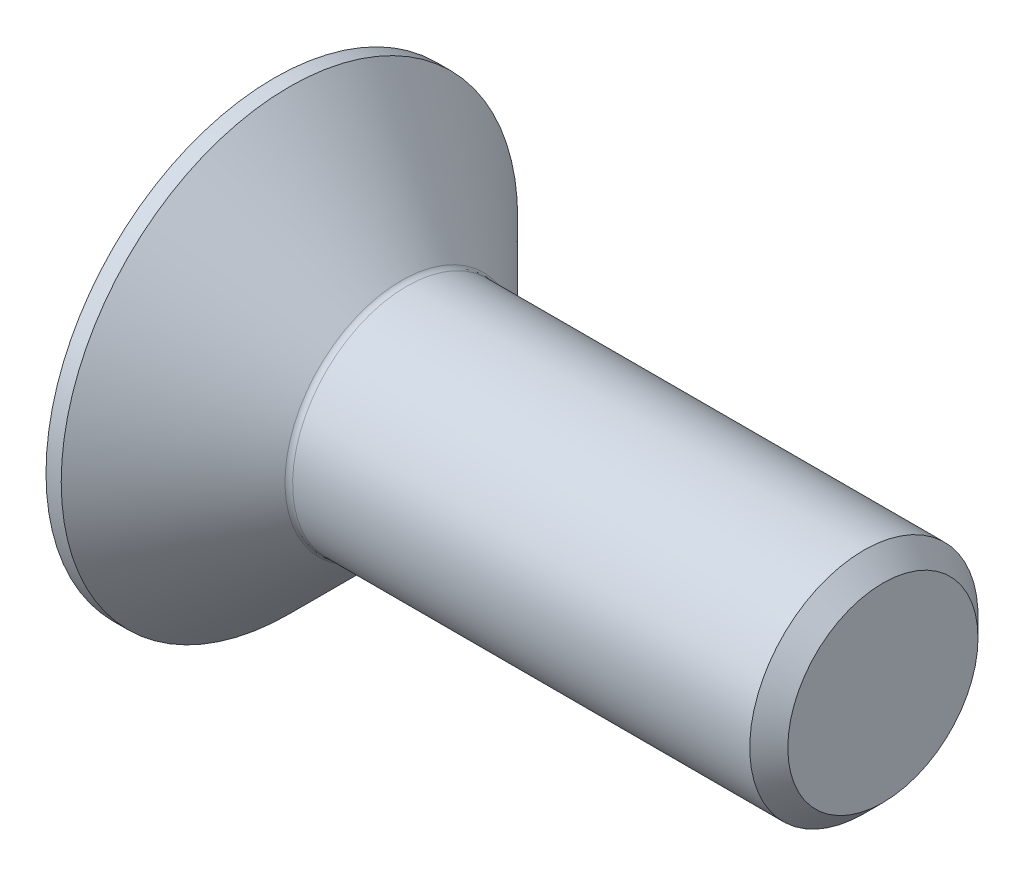
ISO-10303-21;
HEADER;
FILE_DESCRIPTION(('STEP AP214'),'2;1');
FILE_NAME('part.step','',(''),(''),'','','');
FILE_SCHEMA(('AUTOMOTIVE_DESIGN { 1 0 10303 214 1 1 1 1 }'));
ENDSEC;
DATA;
#1=APPLICATION_CONTEXT('core data for automotive mechanical design processes');
#2=APPLICATION_PROTOCOL_DEFINITION('international standard','automotive_design',2000,#1);
#3=PRODUCT_CONTEXT('',#1,'mechanical');
#4=PRODUCT('Part','Part','',(#3));
#5=PRODUCT_RELATED_PRODUCT_CATEGORY('part','',(#4));
#6=PRODUCT_DEFINITION_FORMATION('','',#4);
#7=PRODUCT_DEFINITION_CONTEXT('part definition',#1,'design');
#8=PRODUCT_DEFINITION('design','',#6,#7);
#9=PRODUCT_DEFINITION_SHAPE('','',#8);
#10=(LENGTH_UNIT() NAMED_UNIT(*) SI_UNIT(.MILLI.,.METRE.));
#11=(NAMED_UNIT(*) PLANE_ANGLE_UNIT() SI_UNIT($,.RADIAN.));
#12=(NAMED_UNIT(*) SI_UNIT($,.STERADIAN.) SOLID_ANGLE_UNIT());
#13=UNCERTAINTY_MEASURE_WITH_UNIT(LENGTH_MEASURE(1.E-05),#10,'distance_accuracy_value','');
#14=(GEOMETRIC_REPRESENTATION_CONTEXT(3) GLOBAL_UNCERTAINTY_ASSIGNED_CONTEXT((#13)) GLOBAL_UNIT_ASSIGNED_CONTEXT((#10,
#11,#12)) REPRESENTATION_CONTEXT('',''));
#15=CARTESIAN_POINT('',(0.,0.,0.));
#16=DIRECTION('',(0.,0.,1.));
#17=DIRECTION('',(1.,0.,0.));
#18=AXIS2_PLACEMENT_3D('',#15,#16,#17);
#19=CARTESIAN_POINT('',(1.2,0.,0.));
#20=DIRECTION('',(1.,0.,0.));
#21=DIRECTION('',(0.,1.,0.));
#22=AXIS2_PLACEMENT_3D('',#19,#20,#21);
#23=PLANE('',#22);
#24=DIRECTION('',(0.,-0.5,-0.866025403784439));
#25=VECTOR('',#24,1.);
#26=CARTESIAN_POINT('',(1.2,-1.15470053837925,0.));
#27=LINE('',#26,#25);
#28=CARTESIAN_POINT('',(1.2,-1.15470053837925,0.));
#29=VERTEX_POINT('',#28);
#30=CARTESIAN_POINT('',(1.2,-0.577350269189626,1.));
#31=VERTEX_POINT('',#30);
#32=EDGE_CURVE('E126',#29,#31,#27,.F.);
#33=ORIENTED_EDGE('',*,*,#32,.T.);
#34=DIRECTION('',(0.,-1.,0.));
#35=VECTOR('',#34,1.);
#36=CARTESIAN_POINT('',(1.2,-0.577350269189626,1.));
#37=LINE('',#36,#35);
#38=CARTESIAN_POINT('',(1.2,0.577350269189626,1.));
#39=VERTEX_POINT('',#38);
#40=EDGE_CURVE('E130',#31,#39,#37,.F.);
#41=ORIENTED_EDGE('',*,*,#40,.T.);
#42=DIRECTION('',(0.,-0.499999999999999,0.866025403784439));
#43=VECTOR('',#42,1.);
#44=CARTESIAN_POINT('',(1.2,0.577350269189626,1.));
#45=LINE('',#44,#43);
#46=CARTESIAN_POINT('',(1.2,1.15470053837925,0.));
#47=VERTEX_POINT('',#46);
#48=EDGE_CURVE('E135',#39,#47,#45,.F.);
#49=ORIENTED_EDGE('',*,*,#48,.T.);
#50=DIRECTION('',(0.,0.5,0.866025403784439));
#51=VECTOR('',#50,1.);
#52=CARTESIAN_POINT('',(1.2,1.15470053837925,0.));
#53=LINE('',#52,#51);
#54=CARTESIAN_POINT('',(1.2,0.577350269189626,-1.));
#55=VERTEX_POINT('',#54);
#56=EDGE_CURVE('E85',#47,#55,#53,.F.);
#57=ORIENTED_EDGE('',*,*,#56,.T.);
#58=DIRECTION('',(0.,1.,0.));
#59=VECTOR('',#58,1.);
#60=CARTESIAN_POINT('',(1.2,0.577350269189626,-1.));
#61=LINE('',#60,#59);
#62=CARTESIAN_POINT('',(1.2,-0.577350269189627,-1.));
#63=VERTEX_POINT('',#62);
#64=EDGE_CURVE('E69',#55,#63,#61,.F.);
#65=ORIENTED_EDGE('',*,*,#64,.T.);
#66=DIRECTION('',(0.,0.499999999999999,-0.866025403784439));
#67=VECTOR('',#66,1.);
#68=CARTESIAN_POINT('',(1.2,-0.577350269189627,-1.));
#69=LINE('',#68,#67);
#70=EDGE_CURVE('E74',#63,#29,#69,.F.);
#71=ORIENTED_EDGE('',*,*,#70,.T.);
#72=EDGE_LOOP('',(#33,#41,#49,#57,#65,#71));
#73=FACE_BOUND('',#72,.T.);
#74=ADVANCED_FACE('F19',(#73),#23,.F.);
#75=CARTESIAN_POINT('',(0.,-0.577350269189626,-1.));
#76=DIRECTION('',(0.,-0.866025403784439,-0.499999999999999));
#77=DIRECTION('',(0.,0.499999999999999,-0.866025403784439));
#78=AXIS2_PLACEMENT_3D('',#75,#76,#77);
#79=PLANE('',#78);
#80=DIRECTION('',(1.,0.,0.));
#81=VECTOR('',#80,1.);
#82=CARTESIAN_POINT('',(0.,-0.577350269189627,-1.));
#83=LINE('',#82,#81);
#84=CARTESIAN_POINT('',(0.,-0.577350269189626,-1.));
#85=VERTEX_POINT('',#84);
#86=EDGE_CURVE('E76',#63,#85,#83,.F.);
#87=ORIENTED_EDGE('',*,*,#86,.T.);
#88=DIRECTION('',(0.,0.499999999999999,-0.866025403784439));
#89=VECTOR('',#88,1.);
#90=CARTESIAN_POINT('',(0.,-1.15470053837925,0.));
#91=LINE('',#90,#89);
#92=CARTESIAN_POINT('',(0.,-1.15470053837925,0.));
#93=VERTEX_POINT('',#92);
#94=EDGE_CURVE('E124',#93,#85,#91,.T.);
#95=ORIENTED_EDGE('',*,*,#94,.F.);
#96=DIRECTION('',(1.,0.,0.));
#97=VECTOR('',#96,1.);
#98=CARTESIAN_POINT('',(0.,-1.15470053837925,0.));
#99=LINE('',#98,#97);
#100=EDGE_CURVE('E79',#93,#29,#99,.T.);
#101=ORIENTED_EDGE('',*,*,#100,.T.);
#102=ORIENTED_EDGE('',*,*,#70,.F.);
#103=EDGE_LOOP('',(#87,#95,#101,#102));
#104=FACE_BOUND('',#103,.T.);
#105=ADVANCED_FACE('F75',(#104),#79,.F.);
#106=CARTESIAN_POINT('',(0.,0.577350269189626,-1.));
#107=DIRECTION('',(0.,0.,-1.));
#108=DIRECTION('',(0.,1.,0.));
#109=AXIS2_PLACEMENT_3D('',#106,#107,#108);
#110=PLANE('',#109);
#111=DIRECTION('',(1.,0.,0.));
#112=VECTOR('',#111,1.);
#113=CARTESIAN_POINT('',(0.,0.577350269189625,-1.));
#114=LINE('',#113,#112);
#115=CARTESIAN_POINT('',(0.,0.577350269189626,-1.));
#116=VERTEX_POINT('',#115);
#117=EDGE_CURVE('E87',#55,#116,#114,.F.);
#118=ORIENTED_EDGE('',*,*,#117,.T.);
#119=DIRECTION('',(0.,-1.,0.));
#120=VECTOR('',#119,1.);
#121=CARTESIAN_POINT('',(0.,-1.5,-1.));
#122=LINE('',#121,#120);
#123=EDGE_CURVE('E91',#85,#116,#122,.F.);
#124=ORIENTED_EDGE('',*,*,#123,.F.);
#125=ORIENTED_EDGE('',*,*,#86,.F.);
#126=ORIENTED_EDGE('',*,*,#64,.F.);
#127=EDGE_LOOP('',(#118,#124,#125,#126));
#128=FACE_BOUND('',#127,.T.);
#129=ADVANCED_FACE('F89',(#128),#110,.F.);
#130=CARTESIAN_POINT('',(0.,1.15470053837925,0.));
#131=DIRECTION('',(0.,0.866025403784439,-0.5));
#132=DIRECTION('',(0.,0.5,0.866025403784439));
#133=AXIS2_PLACEMENT_3D('',#130,#131,#132);
#134=PLANE('',#133);
#135=DIRECTION('',(1.,0.,0.));
#136=VECTOR('',#135,1.);
#137=CARTESIAN_POINT('',(0.,1.15470053837925,0.));
#138=LINE('',#137,#136);
#139=CARTESIAN_POINT('',(0.,1.15470053837925,0.));
#140=VERTEX_POINT('',#139);
#141=EDGE_CURVE('E137',#47,#140,#138,.F.);
#142=ORIENTED_EDGE('',*,*,#141,.T.);
#143=DIRECTION('',(0.,0.499999999999999,0.866025403784439));
#144=VECTOR('',#143,1.);
#145=CARTESIAN_POINT('',(0.,0.577350269189626,-1.));
#146=LINE('',#145,#144);
#147=EDGE_CURVE('E120',#116,#140,#146,.T.);
#148=ORIENTED_EDGE('',*,*,#147,.F.);
#149=ORIENTED_EDGE('',*,*,#117,.F.);
#150=ORIENTED_EDGE('',*,*,#56,.F.);
#151=EDGE_LOOP('',(#142,#148,#149,#150));
#152=FACE_BOUND('',#151,.T.);
#153=ADVANCED_FACE('F141',(#152),#134,.F.);
#154=CARTESIAN_POINT('',(0.,0.577350269189626,1.));
#155=DIRECTION('',(0.,0.866025403784439,0.499999999999999));
#156=DIRECTION('',(0.,-0.499999999999999,0.866025403784439));
#157=AXIS2_PLACEMENT_3D('',#154,#155,#156);
#158=PLANE('',#157);
#159=DIRECTION('',(1.,0.,0.));
#160=VECTOR('',#159,1.);
#161=CARTESIAN_POINT('',(0.,0.577350269189626,1.));
#162=LINE('',#161,#160);
#163=CARTESIAN_POINT('',(0.,0.577350269189626,1.));
#164=VERTEX_POINT('',#163);
#165=EDGE_CURVE('E133',#39,#164,#162,.F.);
#166=ORIENTED_EDGE('',*,*,#165,.T.);
#167=DIRECTION('',(0.,-0.499999999999999,0.866025403784439));
#168=VECTOR('',#167,1.);
#169=CARTESIAN_POINT('',(0.,1.15470053837925,0.));
#170=LINE('',#169,#168);
#171=EDGE_CURVE('E117',#140,#164,#170,.T.);
#172=ORIENTED_EDGE('',*,*,#171,.F.);
#173=ORIENTED_EDGE('',*,*,#141,.F.);
#174=ORIENTED_EDGE('',*,*,#48,.F.);
#175=EDGE_LOOP('',(#166,#172,#173,#174));
#176=FACE_BOUND('',#175,.T.);
#177=ADVANCED_FACE('F152',(#176),#158,.F.);
#178=CARTESIAN_POINT('',(0.,-0.577350269189626,1.));
#179=DIRECTION('',(0.,0.,1.));
#180=DIRECTION('',(0.,-1.,0.));
#181=AXIS2_PLACEMENT_3D('',#178,#179,#180);
#182=PLANE('',#181);
#183=DIRECTION('',(1.,0.,0.));
#184=VECTOR('',#183,1.);
#185=CARTESIAN_POINT('',(0.,-0.577350269189625,1.));
#186=LINE('',#185,#184);
#187=CARTESIAN_POINT('',(0.,-0.577350269189626,1.));
#188=VERTEX_POINT('',#187);
#189=EDGE_CURVE('E37',#31,#188,#186,.F.);
#190=ORIENTED_EDGE('',*,*,#189,.T.);
#191=DIRECTION('',(0.,-1.,0.));
#192=VECTOR('',#191,1.);
#193=CARTESIAN_POINT('',(0.,-1.5,1.));
#194=LINE('',#193,#192);
#195=EDGE_CURVE('E114',#164,#188,#194,.T.);
#196=ORIENTED_EDGE('',*,*,#195,.F.);
#197=ORIENTED_EDGE('',*,*,#165,.F.);
#198=ORIENTED_EDGE('',*,*,#40,.F.);
#199=EDGE_LOOP('',(#190,#196,#197,#198));
#200=FACE_BOUND('',#199,.T.);
#201=ADVANCED_FACE('F150',(#200),#182,.F.);
#202=CARTESIAN_POINT('',(0.,-1.15470053837925,0.));
#203=DIRECTION('',(0.,-0.866025403784439,0.5));
#204=DIRECTION('',(0.,-0.5,-0.866025403784439));
#205=AXIS2_PLACEMENT_3D('',#202,#203,#204);
#206=PLANE('',#205);
#207=ORIENTED_EDGE('',*,*,#100,.F.);
#208=DIRECTION('',(0.,-0.499999999999999,-0.866025403784439));
#209=VECTOR('',#208,1.);
#210=CARTESIAN_POINT('',(0.,-0.577350269189626,1.));
#211=LINE('',#210,#209);
#212=EDGE_CURVE('E108',#188,#93,#211,.T.);
#213=ORIENTED_EDGE('',*,*,#212,.F.);
#214=ORIENTED_EDGE('',*,*,#189,.F.);
#215=ORIENTED_EDGE('',*,*,#32,.F.);
#216=EDGE_LOOP('',(#207,#213,#214,#215));
#217=FACE_BOUND('',#216,.T.);
#218=ADVANCED_FACE('F148',(#217),#206,.F.);
#219=CARTESIAN_POINT('',(0.,-1.5,0.));
#220=DIRECTION('',(-1.,0.,0.));
#221=DIRECTION('',(0.,-1.,0.));
#222=AXIS2_PLACEMENT_3D('',#219,#220,#221);
#223=PLANE('',#222);
#224=ORIENTED_EDGE('',*,*,#195,.T.);
#225=ORIENTED_EDGE('',*,*,#212,.T.);
#226=ORIENTED_EDGE('',*,*,#94,.T.);
#227=ORIENTED_EDGE('',*,*,#123,.T.);
#228=ORIENTED_EDGE('',*,*,#147,.T.);
#229=ORIENTED_EDGE('',*,*,#171,.T.);
#230=EDGE_LOOP('',(#224,#225,#226,#227,#228,#229));
#231=FACE_BOUND('',#230,.T.);
#232=CARTESIAN_POINT('',(0.,0.,0.));
#233=DIRECTION('',(1.,0.,0.));
#234=DIRECTION('',(0.,1.,0.));
#235=AXIS2_PLACEMENT_3D('',#232,#233,#234);
#236=CIRCLE('',#235,3.);
#237=CARTESIAN_POINT('',(0.,3.,0.));
#238=VERTEX_POINT('',#237);
#239=EDGE_CURVE('E22',#238,#238,#236,.T.);
#240=ORIENTED_EDGE('',*,*,#239,.F.);
#241=EDGE_LOOP('',(#240));
#242=FACE_BOUND('',#241,.T.);
#243=ADVANCED_FACE('F145',(#231,#242),#223,.T.);
#244=CARTESIAN_POINT('',(0.100000000000001,0.,0.));
#245=DIRECTION('',(1.,0.,0.));
#246=DIRECTION('',(0.,1.,0.));
#247=AXIS2_PLACEMENT_3D('',#244,#245,#246);
#248=CYLINDRICAL_SURFACE('',#247,3.);
#249=ORIENTED_EDGE('',*,*,#239,.T.);
#250=EDGE_LOOP('',(#249));
#251=FACE_BOUND('',#250,.T.);
#252=CARTESIAN_POINT('',(0.200000000063484,0.,0.));
#253=DIRECTION('',(-1.,0.,0.));
#254=DIRECTION('',(0.,-1.,0.));
#255=AXIS2_PLACEMENT_3D('',#252,#253,#254);
#256=CIRCLE('',#255,2.9999999999859);
#257=CARTESIAN_POINT('',(0.200000000063483,-2.9999999999859,0.));
#258=VERTEX_POINT('',#257);
#259=EDGE_CURVE('E98',#258,#258,#256,.F.);
#260=ORIENTED_EDGE('',*,*,#259,.F.);
#261=EDGE_LOOP('',(#260));
#262=FACE_BOUND('',#261,.T.);
#263=ADVANCED_FACE('F193',(#251,#262),#248,.T.);
#264=CARTESIAN_POINT('',(8.,-0.750000000000005,0.));
#265=DIRECTION('',(1.,0.,0.));
#266=DIRECTION('',(0.,1.,0.));
#267=AXIS2_PLACEMENT_3D('',#264,#265,#266);
#268=PLANE('',#267);
#269=CARTESIAN_POINT('',(7.99999999998136,0.,0.));
#270=DIRECTION('',(-1.,0.,0.));
#271=DIRECTION('',(0.,-1.,0.));
#272=AXIS2_PLACEMENT_3D('',#269,#270,#271);
#273=CIRCLE('',#272,1.25000000002729);
#274=CARTESIAN_POINT('',(7.99999999998136,-1.25000000002729,0.));
#275=VERTEX_POINT('',#274);
#276=EDGE_CURVE('E95',#275,#275,#273,.T.);
#277=ORIENTED_EDGE('',*,*,#276,.F.);
#278=EDGE_LOOP('',(#277));
#279=FACE_BOUND('',#278,.T.);
#280=ADVANCED_FACE('F189',(#279),#268,.T.);
#281=CARTESIAN_POINT('',(0.200000000006641,0.,0.));
#282=DIRECTION('',(-1.,0.,0.));
#283=DIRECTION('',(0.,-1.,0.));
#284=AXIS2_PLACEMENT_3D('',#281,#282,#283);
#285=CONICAL_SURFACE('',#284,3.00000000009959,0.785398163397449);
#286=ORIENTED_EDGE('',*,*,#259,.T.);
#287=EDGE_LOOP('',(#286));
#288=FACE_BOUND('',#287,.T.);
#289=CARTESIAN_POINT('',(1.67071067811866,0.,0.));
#290=DIRECTION('',(1.,0.,0.));
#291=DIRECTION('',(0.,0.,-1.));
#292=AXIS2_PLACEMENT_3D('',#289,#290,#291);
#293=CIRCLE('',#292,1.52928932188134);
#294=CARTESIAN_POINT('',(1.67071067811866,0.,-1.52928932188134));
#295=VERTEX_POINT('',#294);
#296=EDGE_CURVE('E97',#295,#295,#293,.F.);
#297=ORIENTED_EDGE('',*,*,#296,.T.);
#298=EDGE_LOOP('',(#297));
#299=FACE_BOUND('',#298,.T.);
#300=ADVANCED_FACE('F185',(#288,#299),#285,.T.);
#301=CARTESIAN_POINT('',(7.75000000004411,0.,0.));
#302=DIRECTION('',(-1.,0.,0.));
#303=DIRECTION('',(0.,-1.,0.));
#304=AXIS2_PLACEMENT_3D('',#301,#302,#303);
#305=CONICAL_SURFACE('',#304,1.49999999990769,0.785398163283761);
#306=CARTESIAN_POINT('',(7.75000000000001,0.,0.));
#307=DIRECTION('',(1.,0.,0.));
#308=DIRECTION('',(0.,1.,0.));
#309=AXIS2_PLACEMENT_3D('',#306,#307,#308);
#310=CIRCLE('',#309,1.5);
#311=CARTESIAN_POINT('',(7.75000000000001,1.5,0.));
#312=VERTEX_POINT('',#311);
#313=EDGE_CURVE('E28',#312,#312,#310,.F.);
#314=ORIENTED_EDGE('',*,*,#313,.F.);
#315=EDGE_LOOP('',(#314));
#316=FACE_BOUND('',#315,.T.);
#317=ORIENTED_EDGE('',*,*,#276,.T.);
#318=EDGE_LOOP('',(#317));
#319=FACE_BOUND('',#318,.T.);
#320=ADVANCED_FACE('F170',(#316,#319),#305,.T.);
#321=CARTESIAN_POINT('',(1.74142135623731,0.,0.));
#322=DIRECTION('',(1.,0.,0.));
#323=DIRECTION('',(0.,0.,-1.));
#324=AXIS2_PLACEMENT_3D('',#321,#322,#323);
#325=TOROIDAL_SURFACE('',#324,1.6,0.1);
#326=CARTESIAN_POINT('',(1.74142135623731,0.,0.));
#327=DIRECTION('',(1.,0.,0.));
#328=DIRECTION('',(0.,1.,0.));
#329=AXIS2_PLACEMENT_3D('',#326,#327,#328);
#330=CIRCLE('',#329,1.5);
#331=CARTESIAN_POINT('',(1.74142135623731,1.5,0.));
#332=VERTEX_POINT('',#331);
#333=EDGE_CURVE('E11',#332,#332,#330,.T.);
#334=ORIENTED_EDGE('',*,*,#333,.F.);
#335=EDGE_LOOP('',(#334));
#336=FACE_BOUND('',#335,.T.);
#337=ORIENTED_EDGE('',*,*,#296,.F.);
#338=EDGE_LOOP('',(#337));
#339=FACE_BOUND('',#338,.T.);
#340=ADVANCED_FACE('F164',(#336,#339),#325,.F.);
#341=CARTESIAN_POINT('',(4.85,0.,0.));
#342=DIRECTION('',(1.,0.,0.));
#343=DIRECTION('',(0.,1.,0.));
#344=AXIS2_PLACEMENT_3D('',#341,#342,#343);
#345=CYLINDRICAL_SURFACE('',#344,1.5);
#346=ORIENTED_EDGE('',*,*,#333,.T.);
#347=EDGE_LOOP('',(#346));
#348=FACE_BOUND('',#347,.T.);
#349=ORIENTED_EDGE('',*,*,#313,.T.);
#350=EDGE_LOOP('',(#349));
#351=FACE_BOUND('',#350,.T.);
#352=ADVANCED_FACE('F162',(#348,#351),#345,.T.);
#353=CLOSED_SHELL('',(#74,#105,#129,#153,#177,#201,#218,#243,#263,#280,#300,#320,#340,#352));
#354=MANIFOLD_SOLID_BREP('B1',#353);
#355=ADVANCED_BREP_SHAPE_REPRESENTATION('',(#18,#354),#14);
#356=SHAPE_DEFINITION_REPRESENTATION(#9,#355);
ENDSEC;
END-ISO-10303-21;
